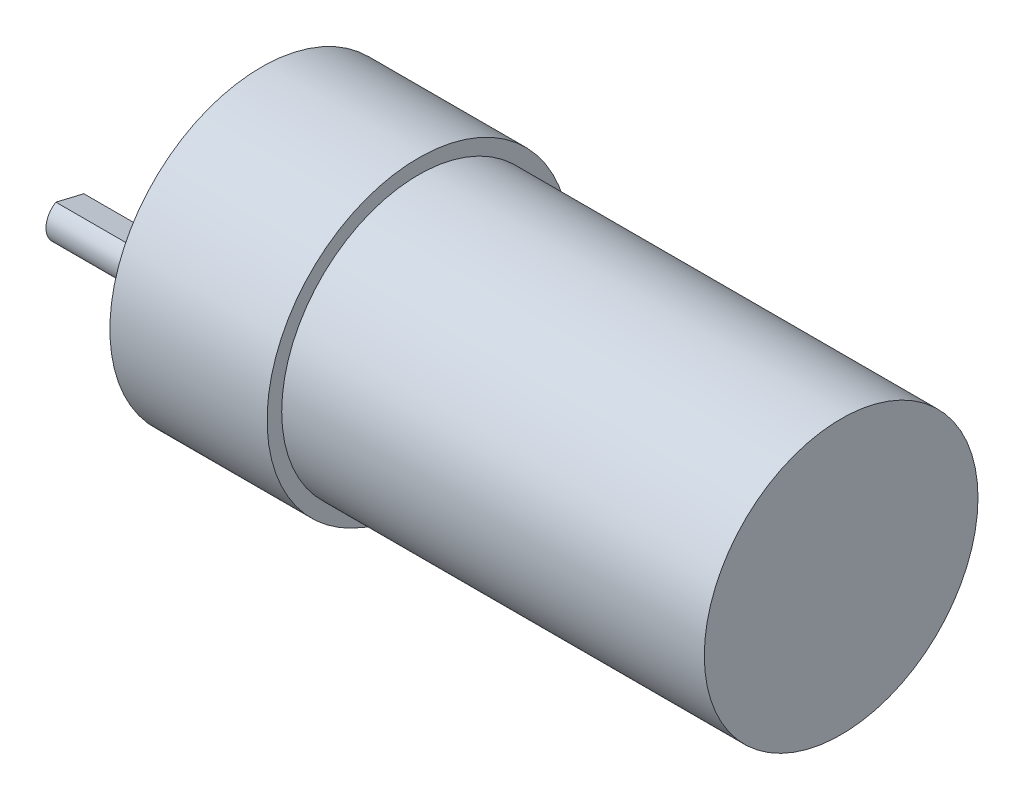
ISO-10303-21;
HEADER;
FILE_DESCRIPTION(('STEP AP214'),'2;1');
FILE_NAME('part.step','',(''),(''),'','','');
FILE_SCHEMA(('AUTOMOTIVE_DESIGN { 1 0 10303 214 1 1 1 1 }'));
ENDSEC;
DATA;
#1=APPLICATION_CONTEXT('core data for automotive mechanical design processes');
#2=APPLICATION_PROTOCOL_DEFINITION('international standard','automotive_design',2000,#1);
#3=PRODUCT_CONTEXT('',#1,'mechanical');
#4=PRODUCT('Part','Part','',(#3));
#5=PRODUCT_RELATED_PRODUCT_CATEGORY('part','',(#4));
#6=PRODUCT_DEFINITION_FORMATION('','',#4);
#7=PRODUCT_DEFINITION_CONTEXT('part definition',#1,'design');
#8=PRODUCT_DEFINITION('design','',#6,#7);
#9=PRODUCT_DEFINITION_SHAPE('','',#8);
#10=(LENGTH_UNIT() NAMED_UNIT(*) SI_UNIT(.MILLI.,.METRE.));
#11=(NAMED_UNIT(*) PLANE_ANGLE_UNIT() SI_UNIT($,.RADIAN.));
#12=(NAMED_UNIT(*) SI_UNIT($,.STERADIAN.) SOLID_ANGLE_UNIT());
#13=UNCERTAINTY_MEASURE_WITH_UNIT(LENGTH_MEASURE(1.E-05),#10,'distance_accuracy_value','');
#14=(GEOMETRIC_REPRESENTATION_CONTEXT(3) GLOBAL_UNCERTAINTY_ASSIGNED_CONTEXT((#13)) GLOBAL_UNIT_ASSIGNED_CONTEXT((#10,
#11,#12)) REPRESENTATION_CONTEXT('',''));
#15=CARTESIAN_POINT('',(0.,0.,0.));
#16=DIRECTION('',(0.,0.,1.));
#17=DIRECTION('',(1.,0.,0.));
#18=AXIS2_PLACEMENT_3D('',#15,#16,#17);
#19=CARTESIAN_POINT('',(-40.8432,-8.71855,0.));
#20=DIRECTION('',(1.,0.,0.));
#21=DIRECTION('',(0.,0.,1.));
#22=AXIS2_PLACEMENT_3D('',#19,#20,#21);
#23=CYLINDRICAL_SURFACE('',#22,2.3749);
#24=CARTESIAN_POINT('',(-18.2372,-8.71855,0.));
#25=DIRECTION('',(1.,0.,0.));
#26=DIRECTION('',(0.,0.,-1.));
#27=AXIS2_PLACEMENT_3D('',#24,#25,#26);
#28=CIRCLE('',#27,2.3749);
#29=CARTESIAN_POINT('',(-18.2372,-8.71855,-2.3749));
#30=VERTEX_POINT('',#29);
#31=EDGE_CURVE('E92',#30,#30,#28,.T.);
#32=ORIENTED_EDGE('',*,*,#31,.F.);
#33=EDGE_LOOP('',(#32));
#34=FACE_BOUND('',#33,.T.);
#35=DIRECTION('',(1.,0.,0.));
#36=VECTOR('',#35,1.);
#37=CARTESIAN_POINT('',(-40.8432,-6.68747817064265,1.23081161596361));
#38=LINE('',#37,#36);
#39=CARTESIAN_POINT('',(-25.8572,-6.68747817064265,1.23081161596361));
#40=VERTEX_POINT('',#39);
#41=CARTESIAN_POINT('',(-40.8432,-6.68747817064265,1.23081161596361));
#42=VERTEX_POINT('',#41);
#43=EDGE_CURVE('E66',#40,#42,#38,.F.);
#44=ORIENTED_EDGE('',*,*,#43,.T.);
#45=CARTESIAN_POINT('',(-40.8432,-8.71855,0.));
#46=DIRECTION('',(1.,0.,0.));
#47=DIRECTION('',(0.,0.,-1.));
#48=AXIS2_PLACEMENT_3D('',#45,#46,#47);
#49=CIRCLE('',#48,2.3749);
#50=CARTESIAN_POINT('',(-40.8432,-7.46406700754952,-2.01653723785416));
#51=VERTEX_POINT('',#50);
#52=EDGE_CURVE('E72',#42,#51,#49,.T.);
#53=ORIENTED_EDGE('',*,*,#52,.T.);
#54=DIRECTION('',(1.,0.,0.));
#55=VECTOR('',#54,1.);
#56=CARTESIAN_POINT('',(-40.8432,-7.46406700754952,-2.01653723785416));
#57=LINE('',#56,#55);
#58=CARTESIAN_POINT('',(-25.8572,-7.46406700754952,-2.01653723785416));
#59=VERTEX_POINT('',#58);
#60=EDGE_CURVE('E63',#51,#59,#57,.T.);
#61=ORIENTED_EDGE('',*,*,#60,.T.);
#62=CARTESIAN_POINT('',(-25.8572,-8.71855,0.));
#63=DIRECTION('',(-1.,0.,0.));
#64=DIRECTION('',(0.,0.,1.));
#65=AXIS2_PLACEMENT_3D('',#62,#63,#64);
#66=CIRCLE('',#65,2.3749);
#67=EDGE_CURVE('E11',#40,#59,#66,.T.);
#68=ORIENTED_EDGE('',*,*,#67,.F.);
#69=EDGE_LOOP('',(#44,#53,#61,#68));
#70=FACE_BOUND('',#69,.T.);
#71=ADVANCED_FACE('F37',(#34,#70),#23,.T.);
#72=CARTESIAN_POINT('',(-40.8432,-8.71855,0.));
#73=DIRECTION('',(-1.,0.,0.));
#74=DIRECTION('',(0.,0.,-1.));
#75=AXIS2_PLACEMENT_3D('',#72,#73,#74);
#76=PLANE('',#75);
#77=ORIENTED_EDGE('',*,*,#52,.F.);
#78=DIRECTION('',(0.,0.232587064676617,0.972575579245703));
#79=VECTOR('',#78,1.);
#80=CARTESIAN_POINT('',(-40.8432,-7.07577258909608,-0.392862810945275));
#81=LINE('',#80,#79);
#82=EDGE_CURVE('E45',#51,#42,#81,.T.);
#83=ORIENTED_EDGE('',*,*,#82,.F.);
#84=EDGE_LOOP('',(#77,#83));
#85=FACE_BOUND('',#84,.T.);
#86=ADVANCED_FACE('F126',(#85),#76,.T.);
#87=CARTESIAN_POINT('',(-18.2372,0.,0.));
#88=DIRECTION('',(-1.,0.,0.));
#89=DIRECTION('',(0.,0.,-1.));
#90=AXIS2_PLACEMENT_3D('',#87,#88,#89);
#91=PLANE('',#90);
#92=CARTESIAN_POINT('',(-18.2372,-8.71855,10.2108));
#93=DIRECTION('',(1.,0.,0.));
#94=DIRECTION('',(0.,0.,-1.));
#95=AXIS2_PLACEMENT_3D('',#92,#93,#94);
#96=CIRCLE('',#95,1.27);
#97=CARTESIAN_POINT('',(-18.2372,-8.71855,8.9408));
#98=VERTEX_POINT('',#97);
#99=EDGE_CURVE('E73',#98,#98,#96,.T.);
#100=ORIENTED_EDGE('',*,*,#99,.T.);
#101=EDGE_LOOP('',(#100));
#102=FACE_BOUND('',#101,.T.);
#103=CARTESIAN_POINT('',(-18.2372,-8.71855,-10.2108));
#104=DIRECTION('',(1.,0.,0.));
#105=DIRECTION('',(0.,0.,-1.));
#106=AXIS2_PLACEMENT_3D('',#103,#104,#105);
#107=CIRCLE('',#106,1.27);
#108=CARTESIAN_POINT('',(-18.2372,-8.71855,-11.4808));
#109=VERTEX_POINT('',#108);
#110=EDGE_CURVE('E81',#109,#109,#107,.T.);
#111=ORIENTED_EDGE('',*,*,#110,.T.);
#112=EDGE_LOOP('',(#111));
#113=FACE_BOUND('',#112,.T.);
#114=CARTESIAN_POINT('',(-18.2372,13.45565,0.));
#115=DIRECTION('',(1.,0.,0.));
#116=DIRECTION('',(0.,0.,-1.));
#117=AXIS2_PLACEMENT_3D('',#114,#115,#116);
#118=CIRCLE('',#117,1.27);
#119=CARTESIAN_POINT('',(-18.2372,13.45565,-1.27));
#120=VERTEX_POINT('',#119);
#121=EDGE_CURVE('E86',#120,#120,#118,.T.);
#122=ORIENTED_EDGE('',*,*,#121,.T.);
#123=EDGE_LOOP('',(#122));
#124=FACE_BOUND('',#123,.T.);
#125=CARTESIAN_POINT('',(-18.2372,0.,0.));
#126=DIRECTION('',(1.,0.,0.));
#127=DIRECTION('',(0.,0.,-1.));
#128=AXIS2_PLACEMENT_3D('',#125,#126,#127);
#129=CIRCLE('',#128,17.56918);
#130=CARTESIAN_POINT('',(-18.2372,0.,-17.56918));
#131=VERTEX_POINT('',#130);
#132=EDGE_CURVE('E99',#131,#131,#129,.T.);
#133=ORIENTED_EDGE('',*,*,#132,.F.);
#134=EDGE_LOOP('',(#133));
#135=FACE_BOUND('',#134,.T.);
#136=ORIENTED_EDGE('',*,*,#31,.T.);
#137=EDGE_LOOP('',(#136));
#138=FACE_BOUND('',#137,.T.);
#139=ADVANCED_FACE('F123',(#102,#113,#124,#135,#138),#91,.T.);
#140=CARTESIAN_POINT('',(49.022,0.,0.));
#141=DIRECTION('',(-1.,0.,0.));
#142=DIRECTION('',(0.,0.,-1.));
#143=AXIS2_PLACEMENT_3D('',#140,#141,#142);
#144=CYLINDRICAL_SURFACE('',#143,15.875);
#145=CARTESIAN_POINT('',(49.022,0.,0.));
#146=DIRECTION('',(-1.,0.,0.));
#147=DIRECTION('',(0.,0.,1.));
#148=AXIS2_PLACEMENT_3D('',#145,#146,#147);
#149=CIRCLE('',#148,15.875);
#150=CARTESIAN_POINT('',(49.022,0.,15.875));
#151=VERTEX_POINT('',#150);
#152=EDGE_CURVE('E107',#151,#151,#149,.T.);
#153=ORIENTED_EDGE('',*,*,#152,.T.);
#154=EDGE_LOOP('',(#153));
#155=FACE_BOUND('',#154,.T.);
#156=CARTESIAN_POINT('',(0.,0.,0.));
#157=DIRECTION('',(1.,0.,0.));
#158=DIRECTION('',(0.,0.,-1.));
#159=AXIS2_PLACEMENT_3D('',#156,#157,#158);
#160=CIRCLE('',#159,15.875);
#161=CARTESIAN_POINT('',(0.,0.,-15.875));
#162=VERTEX_POINT('',#161);
#163=EDGE_CURVE('E102',#162,#162,#160,.T.);
#164=ORIENTED_EDGE('',*,*,#163,.T.);
#165=EDGE_LOOP('',(#164));
#166=FACE_BOUND('',#165,.T.);
#167=ADVANCED_FACE('F39',(#155,#166),#144,.T.);
#168=CARTESIAN_POINT('',(49.022,0.,0.));
#169=DIRECTION('',(1.,0.,0.));
#170=DIRECTION('',(0.,0.,1.));
#171=AXIS2_PLACEMENT_3D('',#168,#169,#170);
#172=PLANE('',#171);
#173=ORIENTED_EDGE('',*,*,#152,.F.);
#174=EDGE_LOOP('',(#173));
#175=FACE_BOUND('',#174,.T.);
#176=ADVANCED_FACE('F113',(#175),#172,.T.);
#177=CARTESIAN_POINT('',(0.,0.,0.));
#178=DIRECTION('',(-1.,0.,0.));
#179=DIRECTION('',(0.,0.,-1.));
#180=AXIS2_PLACEMENT_3D('',#177,#178,#179);
#181=PLANE('',#180);
#182=CARTESIAN_POINT('',(0.,0.,0.));
#183=DIRECTION('',(1.,0.,0.));
#184=DIRECTION('',(0.,0.,-1.));
#185=AXIS2_PLACEMENT_3D('',#182,#183,#184);
#186=CIRCLE('',#185,17.56918);
#187=CARTESIAN_POINT('',(0.,0.,-17.56918));
#188=VERTEX_POINT('',#187);
#189=EDGE_CURVE('E96',#188,#188,#186,.T.);
#190=ORIENTED_EDGE('',*,*,#189,.T.);
#191=EDGE_LOOP('',(#190));
#192=FACE_BOUND('',#191,.T.);
#193=ORIENTED_EDGE('',*,*,#163,.F.);
#194=EDGE_LOOP('',(#193));
#195=FACE_BOUND('',#194,.T.);
#196=ADVANCED_FACE('F115',(#192,#195),#181,.F.);
#197=CARTESIAN_POINT('',(-18.2372,0.,0.));
#198=DIRECTION('',(1.,0.,0.));
#199=DIRECTION('',(0.,0.,1.));
#200=AXIS2_PLACEMENT_3D('',#197,#198,#199);
#201=CYLINDRICAL_SURFACE('',#200,17.56918);
#202=ORIENTED_EDGE('',*,*,#132,.T.);
#203=EDGE_LOOP('',(#202));
#204=FACE_BOUND('',#203,.T.);
#205=ORIENTED_EDGE('',*,*,#189,.F.);
#206=EDGE_LOOP('',(#205));
#207=FACE_BOUND('',#206,.T.);
#208=ADVANCED_FACE('F120',(#204,#207),#201,.T.);
#209=CARTESIAN_POINT('',(-8.2372,13.45565,0.));
#210=DIRECTION('',(-1.,0.,0.));
#211=DIRECTION('',(0.,0.,-1.));
#212=AXIS2_PLACEMENT_3D('',#209,#210,#211);
#213=CYLINDRICAL_SURFACE('',#212,1.27);
#214=CARTESIAN_POINT('',(-8.2372,13.45565,0.));
#215=DIRECTION('',(1.,0.,0.));
#216=DIRECTION('',(0.,0.,-1.));
#217=AXIS2_PLACEMENT_3D('',#214,#215,#216);
#218=CIRCLE('',#217,1.27);
#219=CARTESIAN_POINT('',(-8.2372,13.45565,-1.27));
#220=VERTEX_POINT('',#219);
#221=EDGE_CURVE('E89',#220,#220,#218,.T.);
#222=ORIENTED_EDGE('',*,*,#221,.T.);
#223=EDGE_LOOP('',(#222));
#224=FACE_BOUND('',#223,.T.);
#225=ORIENTED_EDGE('',*,*,#121,.F.);
#226=EDGE_LOOP('',(#225));
#227=FACE_BOUND('',#226,.T.);
#228=ADVANCED_FACE('F139',(#224,#227),#213,.F.);
#229=CARTESIAN_POINT('',(-8.2372,13.45565,0.));
#230=DIRECTION('',(-1.,0.,0.));
#231=DIRECTION('',(0.,0.,-1.));
#232=AXIS2_PLACEMENT_3D('',#229,#230,#231);
#233=PLANE('',#232);
#234=ORIENTED_EDGE('',*,*,#221,.F.);
#235=EDGE_LOOP('',(#234));
#236=FACE_BOUND('',#235,.T.);
#237=ADVANCED_FACE('F144',(#236),#233,.T.);
#238=CARTESIAN_POINT('',(-8.2372,-8.71855,-10.2108));
#239=DIRECTION('',(-1.,0.,0.));
#240=DIRECTION('',(0.,0.,-1.));
#241=AXIS2_PLACEMENT_3D('',#238,#239,#240);
#242=CYLINDRICAL_SURFACE('',#241,1.27);
#243=CARTESIAN_POINT('',(-8.2372,-8.71855,-10.2108));
#244=DIRECTION('',(1.,0.,0.));
#245=DIRECTION('',(0.,0.,-1.));
#246=AXIS2_PLACEMENT_3D('',#243,#244,#245);
#247=CIRCLE('',#246,1.27);
#248=CARTESIAN_POINT('',(-8.2372,-8.71855,-11.4808));
#249=VERTEX_POINT('',#248);
#250=EDGE_CURVE('E83',#249,#249,#247,.T.);
#251=ORIENTED_EDGE('',*,*,#250,.T.);
#252=EDGE_LOOP('',(#251));
#253=FACE_BOUND('',#252,.T.);
#254=ORIENTED_EDGE('',*,*,#110,.F.);
#255=EDGE_LOOP('',(#254));
#256=FACE_BOUND('',#255,.T.);
#257=ADVANCED_FACE('F156',(#253,#256),#242,.F.);
#258=CARTESIAN_POINT('',(-8.2372,-8.71855,-10.2108));
#259=DIRECTION('',(-1.,0.,0.));
#260=DIRECTION('',(0.,0.,-1.));
#261=AXIS2_PLACEMENT_3D('',#258,#259,#260);
#262=PLANE('',#261);
#263=ORIENTED_EDGE('',*,*,#250,.F.);
#264=EDGE_LOOP('',(#263));
#265=FACE_BOUND('',#264,.T.);
#266=ADVANCED_FACE('F163',(#265),#262,.T.);
#267=CARTESIAN_POINT('',(-8.2372,-8.71855,10.2108));
#268=DIRECTION('',(-1.,0.,0.));
#269=DIRECTION('',(0.,0.,-1.));
#270=AXIS2_PLACEMENT_3D('',#267,#268,#269);
#271=CYLINDRICAL_SURFACE('',#270,1.27);
#272=CARTESIAN_POINT('',(-8.2372,-8.71855,10.2108));
#273=DIRECTION('',(1.,0.,0.));
#274=DIRECTION('',(0.,0.,-1.));
#275=AXIS2_PLACEMENT_3D('',#272,#273,#274);
#276=CIRCLE('',#275,1.27);
#277=CARTESIAN_POINT('',(-8.2372,-8.71855,8.9408));
#278=VERTEX_POINT('',#277);
#279=EDGE_CURVE('E76',#278,#278,#276,.T.);
#280=ORIENTED_EDGE('',*,*,#279,.T.);
#281=EDGE_LOOP('',(#280));
#282=FACE_BOUND('',#281,.T.);
#283=ORIENTED_EDGE('',*,*,#99,.F.);
#284=EDGE_LOOP('',(#283));
#285=FACE_BOUND('',#284,.T.);
#286=ADVANCED_FACE('F167',(#282,#285),#271,.F.);
#287=CARTESIAN_POINT('',(-8.2372,-8.71855,10.2108));
#288=DIRECTION('',(-1.,0.,0.));
#289=DIRECTION('',(0.,0.,-1.));
#290=AXIS2_PLACEMENT_3D('',#287,#288,#289);
#291=PLANE('',#290);
#292=ORIENTED_EDGE('',*,*,#279,.F.);
#293=EDGE_LOOP('',(#292));
#294=FACE_BOUND('',#293,.T.);
#295=ADVANCED_FACE('F171',(#294),#291,.T.);
#296=CARTESIAN_POINT('',(-25.8572,-8.21958385216718,-5.17577239912827));
#297=DIRECTION('',(1.,0.,0.));
#298=DIRECTION('',(0.,0.,1.));
#299=AXIS2_PLACEMENT_3D('',#296,#297,#298);
#300=PLANE('',#299);
#301=DIRECTION('',(0.,0.232587064676617,0.972575579245703));
#302=VECTOR('',#301,1.);
#303=CARTESIAN_POINT('',(-25.8572,-8.21958385216718,-5.17577239912827));
#304=LINE('',#303,#302);
#305=EDGE_CURVE('E60',#59,#40,#304,.T.);
#306=ORIENTED_EDGE('',*,*,#305,.T.);
#307=ORIENTED_EDGE('',*,*,#67,.T.);
#308=EDGE_LOOP('',(#306,#307));
#309=FACE_BOUND('',#308,.T.);
#310=ADVANCED_FACE('F70',(#309),#300,.F.);
#311=CARTESIAN_POINT('',(-25.8572,-5.65789785603313,5.5360582222337));
#312=DIRECTION('',(0.,0.972575579245703,-0.232587064676617));
#313=DIRECTION('',(0.,-0.232587064676617,-0.972575579245703));
#314=AXIS2_PLACEMENT_3D('',#311,#312,#313);
#315=PLANE('',#314);
#316=ORIENTED_EDGE('',*,*,#60,.F.);
#317=ORIENTED_EDGE('',*,*,#82,.T.);
#318=ORIENTED_EDGE('',*,*,#43,.F.);
#319=ORIENTED_EDGE('',*,*,#305,.F.);
#320=EDGE_LOOP('',(#316,#317,#318,#319));
#321=FACE_BOUND('',#320,.T.);
#322=ADVANCED_FACE('F61',(#321),#315,.T.);
#323=CLOSED_SHELL('',(#71,#86,#139,#167,#176,#196,#208,#228,#237,#257,#266,#286,#295,#310,#322));
#324=MANIFOLD_SOLID_BREP('B2',#323);
#325=ADVANCED_BREP_SHAPE_REPRESENTATION('',(#18,#324),#14);
#326=SHAPE_DEFINITION_REPRESENTATION(#9,#325);
ENDSEC;
END-ISO-10303-21;
